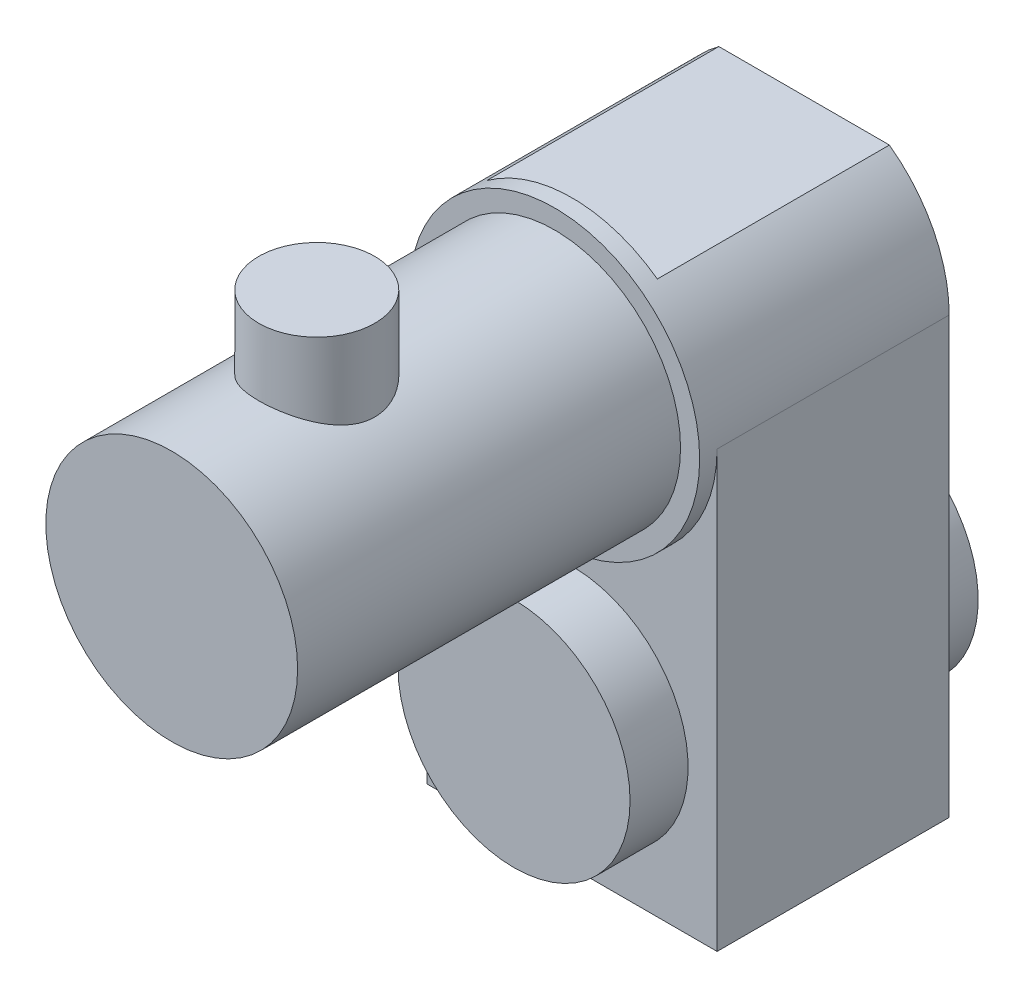
ISO-10303-21;
HEADER;
FILE_DESCRIPTION(('STEP AP214'),'2;1');
FILE_NAME('part.step','',(''),(''),'','','');
FILE_SCHEMA(('AUTOMOTIVE_DESIGN { 1 0 10303 214 1 1 1 1 }'));
ENDSEC;
DATA;
#1=APPLICATION_CONTEXT('core data for automotive mechanical design processes');
#2=APPLICATION_PROTOCOL_DEFINITION('international standard','automotive_design',2000,#1);
#3=PRODUCT_CONTEXT('',#1,'mechanical');
#4=PRODUCT('Part','Part','',(#3));
#5=PRODUCT_RELATED_PRODUCT_CATEGORY('part','',(#4));
#6=PRODUCT_DEFINITION_FORMATION('','',#4);
#7=PRODUCT_DEFINITION_CONTEXT('part definition',#1,'design');
#8=PRODUCT_DEFINITION('design','',#6,#7);
#9=PRODUCT_DEFINITION_SHAPE('','',#8);
#10=(LENGTH_UNIT() NAMED_UNIT(*) SI_UNIT(.MILLI.,.METRE.));
#11=(NAMED_UNIT(*) PLANE_ANGLE_UNIT() SI_UNIT($,.RADIAN.));
#12=(NAMED_UNIT(*) SI_UNIT($,.STERADIAN.) SOLID_ANGLE_UNIT());
#13=UNCERTAINTY_MEASURE_WITH_UNIT(LENGTH_MEASURE(1.E-05),#10,'distance_accuracy_value','');
#14=(GEOMETRIC_REPRESENTATION_CONTEXT(3) GLOBAL_UNCERTAINTY_ASSIGNED_CONTEXT((#13)) GLOBAL_UNIT_ASSIGNED_CONTEXT((#10,
#11,#12)) REPRESENTATION_CONTEXT('',''));
#15=CARTESIAN_POINT('',(0.,0.,0.));
#16=DIRECTION('',(0.,0.,1.));
#17=DIRECTION('',(1.,0.,0.));
#18=AXIS2_PLACEMENT_3D('',#15,#16,#17);
#19=CARTESIAN_POINT('',(0.,0.,0.));
#20=DIRECTION('',(0.,0.,1.));
#21=DIRECTION('',(1.,0.,0.));
#22=AXIS2_PLACEMENT_3D('',#19,#20,#21);
#23=PLANE('',#22);
#24=DIRECTION('',(1.,0.,0.));
#25=VECTOR('',#24,1.);
#26=CARTESIAN_POINT('',(73.4963775843918,101.110249144053,0.));
#27=LINE('',#26,#25);
#28=CARTESIAN_POINT('',(-73.4963775843918,101.110249144053,0.));
#29=VERTEX_POINT('',#28);
#30=CARTESIAN_POINT('',(73.4963775843918,101.110249144053,0.));
#31=VERTEX_POINT('',#30);
#32=EDGE_CURVE('E57',#29,#31,#27,.T.);
#33=ORIENTED_EDGE('',*,*,#32,.F.);
#34=CARTESIAN_POINT('',(0.,0.,0.));
#35=DIRECTION('',(0.,0.,1.));
#36=DIRECTION('',(1.,0.,0.));
#37=AXIS2_PLACEMENT_3D('',#34,#35,#36);
#38=CIRCLE('',#37,125.);
#39=EDGE_CURVE('E127',#31,#29,#38,.T.);
#40=ORIENTED_EDGE('',*,*,#39,.F.);
#41=EDGE_LOOP('',(#33,#40));
#42=FACE_BOUND('',#41,.T.);
#43=ADVANCED_FACE('F35',(#42),#23,.F.);
#44=CARTESIAN_POINT('',(0.,0.,15.));
#45=DIRECTION('',(0.,0.,-1.));
#46=DIRECTION('',(-1.,0.,0.));
#47=AXIS2_PLACEMENT_3D('',#44,#45,#46);
#48=CYLINDRICAL_SURFACE('',#47,125.);
#49=CARTESIAN_POINT('',(0.,0.,15.));
#50=DIRECTION('',(0.,0.,1.));
#51=DIRECTION('',(1.,0.,0.));
#52=AXIS2_PLACEMENT_3D('',#49,#50,#51);
#53=CIRCLE('',#52,125.);
#54=CARTESIAN_POINT('',(125.,0.,15.));
#55=VERTEX_POINT('',#54);
#56=EDGE_CURVE('E124',#55,#55,#53,.T.);
#57=ORIENTED_EDGE('',*,*,#56,.F.);
#58=EDGE_LOOP('',(#57));
#59=FACE_BOUND('',#58,.T.);
#60=CARTESIAN_POINT('',(-125.,0.,0.));
#61=VERTEX_POINT('',#60);
#62=CARTESIAN_POINT('',(125.,0.,0.));
#63=VERTEX_POINT('',#62);
#64=EDGE_CURVE('E50',#61,#63,#38,.T.);
#65=ORIENTED_EDGE('',*,*,#64,.T.);
#66=DIRECTION('',(0.,0.,1.));
#67=VECTOR('',#66,1.);
#68=CARTESIAN_POINT('',(125.,0.,-200.));
#69=LINE('',#68,#67);
#70=CARTESIAN_POINT('',(125.,0.,-200.));
#71=VERTEX_POINT('',#70);
#72=EDGE_CURVE('E93',#71,#63,#69,.T.);
#73=ORIENTED_EDGE('',*,*,#72,.F.);
#74=CARTESIAN_POINT('',(-8.451572774959E-12,-4.3159920082303E-12,-200.));
#75=DIRECTION('',(0.,0.,-1.));
#76=DIRECTION('',(-1.,0.,0.));
#77=AXIS2_PLACEMENT_3D('',#74,#75,#76);
#78=CIRCLE('',#77,125.000000000008);
#79=CARTESIAN_POINT('',(73.4963775843918,101.110249144053,-200.));
#80=VERTEX_POINT('',#79);
#81=EDGE_CURVE('E99',#80,#71,#78,.T.);
#82=ORIENTED_EDGE('',*,*,#81,.F.);
#83=DIRECTION('',(0.,0.,1.));
#84=VECTOR('',#83,1.);
#85=CARTESIAN_POINT('',(73.4963775843918,101.110249144053,-200.));
#86=LINE('',#85,#84);
#87=EDGE_CURVE('E314',#80,#31,#86,.T.);
#88=ORIENTED_EDGE('',*,*,#87,.T.);
#89=ORIENTED_EDGE('',*,*,#39,.T.);
#90=DIRECTION('',(0.,0.,1.));
#91=VECTOR('',#90,1.);
#92=CARTESIAN_POINT('',(-73.4963775843918,101.110249144053,-200.));
#93=LINE('',#92,#91);
#94=CARTESIAN_POINT('',(-73.4963775843918,101.110249144053,-200.));
#95=VERTEX_POINT('',#94);
#96=EDGE_CURVE('E322',#95,#29,#93,.T.);
#97=ORIENTED_EDGE('',*,*,#96,.F.);
#98=CARTESIAN_POINT('',(6.24500451351651E-13,-3.2612801348364E-13,-200.));
#99=DIRECTION('',(0.,0.,-1.));
#100=DIRECTION('',(-1.,0.,0.));
#101=AXIS2_PLACEMENT_3D('',#98,#99,#100);
#102=CIRCLE('',#101,125.000000000001);
#103=CARTESIAN_POINT('',(-125.,0.,-200.));
#104=VERTEX_POINT('',#103);
#105=EDGE_CURVE('E311',#104,#95,#102,.T.);
#106=ORIENTED_EDGE('',*,*,#105,.F.);
#107=DIRECTION('',(0.,0.,1.));
#108=VECTOR('',#107,1.);
#109=CARTESIAN_POINT('',(-125.,0.,-200.));
#110=LINE('',#109,#108);
#111=EDGE_CURVE('E325',#104,#61,#110,.T.);
#112=ORIENTED_EDGE('',*,*,#111,.T.);
#113=EDGE_LOOP('',(#65,#73,#82,#88,#89,#97,#106,#112));
#114=FACE_BOUND('',#113,.T.);
#115=ADVANCED_FACE('F37',(#59,#114),#48,.T.);
#116=CARTESIAN_POINT('',(0.,0.,15.));
#117=DIRECTION('',(0.,0.,1.));
#118=DIRECTION('',(1.,0.,0.));
#119=AXIS2_PLACEMENT_3D('',#116,#117,#118);
#120=PLANE('',#119);
#121=CARTESIAN_POINT('',(0.,0.,15.));
#122=DIRECTION('',(0.,0.,1.));
#123=DIRECTION('',(1.,0.,0.));
#124=AXIS2_PLACEMENT_3D('',#121,#122,#123);
#125=CIRCLE('',#124,108.5);
#126=CARTESIAN_POINT('',(108.5,0.,15.));
#127=VERTEX_POINT('',#126);
#128=EDGE_CURVE('E113',#127,#127,#125,.T.);
#129=ORIENTED_EDGE('',*,*,#128,.F.);
#130=EDGE_LOOP('',(#129));
#131=FACE_BOUND('',#130,.T.);
#132=ORIENTED_EDGE('',*,*,#56,.T.);
#133=EDGE_LOOP('',(#132));
#134=FACE_BOUND('',#133,.T.);
#135=ADVANCED_FACE('F150',(#131,#134),#120,.T.);
#136=CARTESIAN_POINT('',(0.,0.,345.));
#137=DIRECTION('',(0.,0.,-1.));
#138=DIRECTION('',(-1.,0.,0.));
#139=AXIS2_PLACEMENT_3D('',#136,#137,#138);
#140=CYLINDRICAL_SURFACE('',#139,108.5);
#141=CARTESIAN_POINT('',(0.,108.5,270.));
#142=CARTESIAN_POINT('',(-1.32696206149475,108.49999184715,269.999990503253));
#143=CARTESIAN_POINT('',(-2.65417466500484,108.475594848356,269.94710906297));
#144=CARTESIAN_POINT('',(-5.29899301202294,108.378612224787,269.736124858545));
#145=CARTESIAN_POINT('',(-6.61659325685497,108.306000917281,269.577966015267));
#146=CARTESIAN_POINT('',(-9.23443841105052,108.114295731333,269.157766126817));
#147=CARTESIAN_POINT('',(-10.5346428110665,107.995108101183,268.895515542515));
#148=CARTESIAN_POINT('',(-13.1054870587458,107.713362431829,268.270035244358));
#149=CARTESIAN_POINT('',(-14.3761306315122,107.550809889787,267.906818329275));
#150=CARTESIAN_POINT('',(-16.8750052499934,107.187092042421,267.084584064535));
#151=CARTESIAN_POINT('',(-18.1033750329911,106.98607087299,266.625923782468));
#152=CARTESIAN_POINT('',(-20.5152107103846,106.549885900575,265.616175256917));
#153=CARTESIAN_POINT('',(-21.6986753288033,106.314721128317,265.065084389433));
#154=CARTESIAN_POINT('',(-24.0138420241665,105.815818299413,263.875152608911));
#155=CARTESIAN_POINT('',(-25.1455587150909,105.552088381531,263.236336676626));
#156=CARTESIAN_POINT('',(-27.3519501979903,105.001970135357,261.87542254575));
#157=CARTESIAN_POINT('',(-28.4266232475368,104.715581115596,261.153321805316));
#158=CARTESIAN_POINT('',(-30.5699430770528,104.11068294951,259.58954161615));
#159=CARTESIAN_POINT('',(-31.6351689943676,103.791274829477,258.743523718862));
#160=CARTESIAN_POINT('',(-33.6915707166659,103.142089031261,256.969203604267));
#161=CARTESIAN_POINT('',(-34.6827441461133,102.812311020904,256.040898749356));
#162=CARTESIAN_POINT('',(-36.1102863670655,102.315940203102,254.590578087172));
#163=CARTESIAN_POINT('',(-36.5764457713409,102.150129939262,254.097276620902));
#164=CARTESIAN_POINT('',(-37.488369464531,101.818993077173,253.092031636386));
#165=CARTESIAN_POINT('',(-37.9341352984982,101.653666443174,252.58008953568));
#166=CARTESIAN_POINT('',(-38.8046541409788,101.324554544605,251.538224504586));
#167=CARTESIAN_POINT('',(-39.229408630431,101.160769172063,251.008302845898));
#168=CARTESIAN_POINT('',(-40.0574424830926,100.83575367066,249.93097217927));
#169=CARTESIAN_POINT('',(-40.4607155527856,100.674524300255,249.383558120833));
#170=CARTESIAN_POINT('',(-41.6868212936223,100.176189573054,247.645983008476));
#171=CARTESIAN_POINT('',(-42.4707628094322,99.8454724597847,246.426160122134));
#172=CARTESIAN_POINT('',(-43.9323375662214,99.2110628403277,243.917699935727));
#173=CARTESIAN_POINT('',(-44.6099768192685,98.9073688062338,242.629066532863));
#174=CARTESIAN_POINT('',(-45.5419879985755,98.4799165544863,240.650882298602));
#175=CARTESIAN_POINT('',(-45.838578124882,98.342116686029,239.983963848155));
#176=CARTESIAN_POINT('',(-46.4028967814605,98.0771041328612,238.636112630325));
#177=CARTESIAN_POINT('',(-46.6706326630929,97.9498887533721,237.955183485427));
#178=CARTESIAN_POINT('',(-47.1765683428826,97.7072165699477,236.580346962876));
#179=CARTESIAN_POINT('',(-47.4147673867384,97.5917600663199,235.8864392543));
#180=CARTESIAN_POINT('',(-47.8609129057342,97.373736226732,234.486982430335));
#181=CARTESIAN_POINT('',(-48.0688577949849,97.2711695664817,233.78143270684));
#182=CARTESIAN_POINT('',(-48.6250798484449,96.9949370373942,231.727590268775));
#183=CARTESIAN_POINT('',(-48.933654442626,96.8391802158025,230.365815838871));
#184=CARTESIAN_POINT('',(-49.4362784180271,96.5835596810472,227.616294964833));
#185=CARTESIAN_POINT('',(-49.6303320223907,96.4836939068194,226.22854948037));
#186=CARTESIAN_POINT('',(-49.9012165508031,96.343873723886,223.439482371492));
#187=CARTESIAN_POINT('',(-49.9781226504755,96.3038808939374,222.03817003476));
#188=CARTESIAN_POINT('',(-50.0137887636891,96.2853650460038,219.233699366847));
#189=CARTESIAN_POINT('',(-49.9725573079794,96.3068375895851,217.830541176269));
#190=CARTESIAN_POINT('',(-49.7824072723167,96.405246400336,215.17190642304));
#191=CARTESIAN_POINT('',(-49.6444258536115,96.4765472700731,213.91541962773));
#192=CARTESIAN_POINT('',(-49.2744881228048,96.6660126637762,211.420049771231));
#193=CARTESIAN_POINT('',(-49.0425389499149,96.7841736275264,210.181165380096));
#194=CARTESIAN_POINT('',(-48.4871139558731,97.0636192512721,207.728863950343));
#195=CARTESIAN_POINT('',(-48.1636210204798,97.2249119745029,206.515451719389));
#196=CARTESIAN_POINT('',(-47.4283037090085,97.5857240969431,204.121579654354));
#197=CARTESIAN_POINT('',(-47.0164752315451,97.7852452710386,202.941121353188));
#198=CARTESIAN_POINT('',(-46.097589003223,98.2218238977522,200.592841856404));
#199=CARTESIAN_POINT('',(-45.5885699873429,98.4596349918026,199.425926024842));
#200=CARTESIAN_POINT('',(-44.7616690175812,98.8369092782603,197.711078403503));
#201=CARTESIAN_POINT('',(-44.4754583042851,98.9661002211117,197.145357726293));
#202=CARTESIAN_POINT('',(-43.8823118907455,99.230530542835,196.026184620708));
#203=CARTESIAN_POINT('',(-43.5753723507745,99.3657710407278,195.472734490642));
#204=CARTESIAN_POINT('',(-42.6241547562215,99.7793044063888,193.831692261469));
#205=CARTESIAN_POINT('',(-41.9495102314699,100.065394168314,192.763475644041));
#206=CARTESIAN_POINT('',(-40.5233345565621,100.651396042653,190.683629888935));
#207=CARTESIAN_POINT('',(-39.7717981342937,100.95130910209,189.672004638825));
#208=CARTESIAN_POINT('',(-38.5481537375097,101.422423067206,188.148405294664));
#209=CARTESIAN_POINT('',(-38.1013083329258,101.591231788832,187.615222413365));
#210=CARTESIAN_POINT('',(-37.1860427356225,101.929810781875,186.568254060384));
#211=CARTESIAN_POINT('',(-36.7176271700967,102.099580840279,186.054464471122));
#212=CARTESIAN_POINT('',(-35.2806853614013,102.608749649752,184.542900029686));
#213=CARTESIAN_POINT('',(-34.2804333343782,102.948018968357,183.574891325848));
#214=CARTESIAN_POINT('',(-32.2007225652056,103.617360295732,181.723998168457));
#215=CARTESIAN_POINT('',(-31.121236519604,103.947429079494,180.841143303094));
#216=CARTESIAN_POINT('',(-28.8888124321367,104.589843427866,179.166394396951));
#217=CARTESIAN_POINT('',(-27.7358743179883,104.902188975035,178.374500445686));
#218=CARTESIAN_POINT('',(-25.3223144166532,105.511285692345,176.862117880167));
#219=CARTESIAN_POINT('',(-24.0593622815635,105.807143185556,176.144980625508));
#220=CARTESIAN_POINT('',(-21.4693946995538,106.362911929998,174.820574985013));
#221=CARTESIAN_POINT('',(-20.1423769780471,106.622821903678,174.213310503742));
#222=CARTESIAN_POINT('',(-17.4342225687673,107.098957911469,173.115231283393));
#223=CARTESIAN_POINT('',(-16.0531158658935,107.315207751031,172.62435305974));
#224=CARTESIAN_POINT('',(-13.2467649027633,107.697622068747,171.764366292778));
#225=CARTESIAN_POINT('',(-11.8215248747163,107.863791333126,171.395246112675));
#226=CARTESIAN_POINT('',(-9.04541354303032,108.130611919275,170.806069447762));
#227=CARTESIAN_POINT('',(-7.69682446163209,108.235195888614,170.577016790092));
#228=CARTESIAN_POINT('',(-4.98248871170465,108.394061178617,170.230065027786));
#229=CARTESIAN_POINT('',(-3.61674288533486,108.448344958624,170.112160488747));
#230=CARTESIAN_POINT('',(-0.87954775825578,108.505067945424,169.98897379894));
#231=CARTESIAN_POINT('',(0.491899579846575,108.507523718354,169.983655661417));
#232=CARTESIAN_POINT('',(3.22968266518204,108.460561090468,170.085619205596));
#233=CARTESIAN_POINT('',(4.59601857631193,108.411144367492,170.192897245326));
#234=CARTESIAN_POINT('',(7.22606712823257,108.266601798517,170.508332337941));
#235=CARTESIAN_POINT('',(8.49078040689456,108.174582523499,170.709640470707));
#236=CARTESIAN_POINT('',(10.997371245127,107.948558174574,171.207680399908));
#237=CARTESIAN_POINT('',(12.2392500065103,107.814555317056,171.504407159041));
#238=CARTESIAN_POINT('',(14.6923022800147,107.507741466231,172.190393128745));
#239=CARTESIAN_POINT('',(15.9034738284649,107.334927997985,172.579658240544));
#240=CARTESIAN_POINT('',(18.2878624220879,106.954485005605,173.44719386382));
#241=CARTESIAN_POINT('',(19.4610779548012,106.746854096109,173.925467916982));
#242=CARTESIAN_POINT('',(21.7985913638681,106.294552666553,174.983142777684));
#243=CARTESIAN_POINT('',(22.9615015267723,106.048938266458,175.565204659199));
#244=CARTESIAN_POINT('',(25.2340117754535,105.531288828472,176.815205650263));
#245=CARTESIAN_POINT('',(26.343611240036,105.259253482827,177.483145760161));
#246=CARTESIAN_POINT('',(28.5044754089206,104.69475908064,178.900543681469));
#247=CARTESIAN_POINT('',(29.5557193477624,104.402292836441,179.65003023341));
#248=CARTESIAN_POINT('',(31.5948380141804,103.803397129777,181.225957391722));
#249=CARTESIAN_POINT('',(32.5827095941811,103.496966975044,182.052401815442));
#250=CARTESIAN_POINT('',(34.0544852155687,103.018634478328,183.383336838088));
#251=CARTESIAN_POINT('',(34.5624348673959,102.849232885091,183.862410869021));
#252=CARTESIAN_POINT('',(35.5576610429205,102.509409858624,184.841220713372));
#253=CARTESIAN_POINT('',(36.0449386772386,102.338988480745,185.340955413923));
#254=CARTESIAN_POINT('',(36.9981452289964,101.998252112999,186.360377736218));
#255=CARTESIAN_POINT('',(37.4640751161241,101.827937118649,186.880064449698));
#256=CARTESIAN_POINT('',(38.374059131696,101.488509323494,187.938823302328));
#257=CARTESIAN_POINT('',(38.8181075850204,101.319396844202,188.477900408464));
#258=CARTESIAN_POINT('',(40.1165621852611,100.815541302886,190.123354239537));
#259=CARTESIAN_POINT('',(40.9371503969822,100.484326083122,191.257817481722));
#260=CARTESIAN_POINT('',(42.4824450134894,99.8408373428742,193.595368452759));
#261=CARTESIAN_POINT('',(43.2071554477477,99.5285630266566,194.798453294595));
#262=CARTESIAN_POINT('',(44.2283610426945,99.0769710415183,196.668109819704));
#263=CARTESIAN_POINT('',(44.5621371493618,98.9271926468688,197.31204749307));
#264=CARTESIAN_POINT('',(45.2020218777676,98.6364572337708,198.615333407954));
#265=CARTESIAN_POINT('',(45.508137050641,98.4954981290329,199.274677953747));
#266=CARTESIAN_POINT('',(46.0920495749664,98.2236056971569,200.607921704567));
#267=CARTESIAN_POINT('',(46.3698430617873,98.0926737388764,201.281822880752));
#268=CARTESIAN_POINT('',(46.8963461511226,97.8420550605545,202.643006299132));
#269=CARTESIAN_POINT('',(47.145054008241,97.7223690154523,203.330289341474));
#270=CARTESIAN_POINT('',(47.6124318633626,97.4955063733586,204.716324738788));
#271=CARTESIAN_POINT('',(47.8311288228944,97.3883185612513,205.415066159308));
#272=CARTESIAN_POINT('',(48.2380657186767,97.1873989888575,206.823272144494));
#273=CARTESIAN_POINT('',(48.4263059583223,97.0936670945309,207.532736602265));
#274=CARTESIAN_POINT('',(48.7716851557486,96.9206378521882,208.960870152485));
#275=CARTESIAN_POINT('',(48.9288270427158,96.8413391447517,209.679538371227));
#276=CARTESIAN_POINT('',(49.2114705939299,96.6980159740271,211.124577179446));
#277=CARTESIAN_POINT('',(49.3369728846618,96.6339912083063,211.850947616118));
#278=CARTESIAN_POINT('',(49.5461368757242,96.5269021661968,213.244861724335));
#279=CARTESIAN_POINT('',(49.632526665777,96.4824803405472,213.911893240495));
#280=CARTESIAN_POINT('',(49.7783861850178,96.4073078966164,215.249730212616));
#281=CARTESIAN_POINT('',(49.8378534315836,96.376558539126,215.920536010844));
#282=CARTESIAN_POINT('',(49.9296501833039,96.3290335507053,217.264390808045));
#283=CARTESIAN_POINT('',(49.9619839204068,96.3122557406695,217.937439440761));
#284=CARTESIAN_POINT('',(49.9994224438082,96.2928252870462,219.284568893838));
#285=CARTESIAN_POINT('',(50.0045243751537,96.2901741244812,219.958649815013));
#286=CARTESIAN_POINT('',(49.9874767378458,96.2990252440633,221.306147983991));
#287=CARTESIAN_POINT('',(49.9653363126947,96.3105227774058,221.979565378592));
#288=CARTESIAN_POINT('',(49.8938915386398,96.3475541696476,223.324641720082));
#289=CARTESIAN_POINT('',(49.8445841588559,96.3730895946832,223.996300462365));
#290=CARTESIAN_POINT('',(49.7189725881016,96.4379530569606,225.336339459925));
#291=CARTESIAN_POINT('',(49.6426719316027,96.4772792884426,226.004720132817));
#292=CARTESIAN_POINT('',(49.4633280364868,96.5693491988312,227.336972801881));
#293=CARTESIAN_POINT('',(49.360282253194,96.6220941544581,228.000844362861));
#294=CARTESIAN_POINT('',(49.0276789697546,96.7915106628985,229.891660503494));
#295=CARTESIAN_POINT('',(48.7655524524284,96.9241392022563,231.11163862225));
#296=CARTESIAN_POINT('',(48.1524952363855,97.2301603439627,233.523540129014));
#297=CARTESIAN_POINT('',(47.8015697525409,97.4035505524696,234.715465159997));
#298=CARTESIAN_POINT('',(47.014041248206,97.786100583307,237.065030597021));
#299=CARTESIAN_POINT('',(46.5774200365272,97.9952679990836,238.222663663529));
#300=CARTESIAN_POINT('',(45.6220832812351,98.4436578479836,240.49750663564));
#301=CARTESIAN_POINT('',(45.1033628570524,98.6828820677258,241.6147141332));
#302=CARTESIAN_POINT('',(43.9507719301887,99.2018386123404,243.875588057136));
#303=CARTESIAN_POINT('',(43.3115728642342,99.4832001458293,245.016164640363));
#304=CARTESIAN_POINT('',(41.9484590275373,100.065608324201,247.240193459189));
#305=CARTESIAN_POINT('',(41.2245416035932,100.366655585469,248.323643904173));
#306=CARTESIAN_POINT('',(39.6959739122507,100.98097953505,250.42897449615));
#307=CARTESIAN_POINT('',(38.8912932456651,101.294260800917,251.450831225959));
#308=CARTESIAN_POINT('',(37.2055985684003,101.925480012426,253.42800242767));
#309=CARTESIAN_POINT('',(36.3245809820111,102.243418175622,254.383313778723));
#310=CARTESIAN_POINT('',(34.4013720959535,102.907375986398,256.31219801978));
#311=CARTESIAN_POINT('',(33.3518362359986,103.25312876439,257.278557268426));
#312=CARTESIAN_POINT('',(31.1715736068251,103.932125494348,259.119934747322));
#313=CARTESIAN_POINT('',(30.0408407774525,104.265368509812,259.994946147821));
#314=CARTESIAN_POINT('',(27.7037601945411,104.910540854896,261.647941226426));
#315=CARTESIAN_POINT('',(26.4973722671363,105.222458673634,262.425872686943));
#316=CARTESIAN_POINT('',(24.0166833576599,105.816234897773,263.87783629658));
#317=CARTESIAN_POINT('',(22.7423872925281,106.098095475069,264.551875954347));
#318=CARTESIAN_POINT('',(20.1427635983182,106.62205858017,265.785624300879));
#319=CARTESIAN_POINT('',(18.8178578062201,106.864426733446,266.346103589292));
#320=CARTESIAN_POINT('',(16.7933311901756,107.194696168522,267.100994385568));
#321=CARTESIAN_POINT('',(16.1121282176299,107.299259714057,267.338366110313));
#322=CARTESIAN_POINT('',(14.7385558550677,107.496539342476,267.783846291984));
#323=CARTESIAN_POINT('',(14.0461877733764,107.589256802283,267.991958150196));
#324=CARTESIAN_POINT('',(12.653403741467,107.761925724363,268.377807938282));
#325=CARTESIAN_POINT('',(11.9530127721025,107.841909091016,268.555621858695));
#326=CARTESIAN_POINT('',(10.5439517482036,107.988780541837,268.880955397435));
#327=CARTESIAN_POINT('',(9.83528271594334,108.055670225225,269.028478715468));
#328=CARTESIAN_POINT('',(8.41146319929416,108.175817453214,269.292710575638));
#329=CARTESIAN_POINT('',(7.69631625171861,108.229082021139,269.409434994635));
#330=CARTESIAN_POINT('',(6.26082845466192,108.321600526142,269.611765319664));
#331=CARTESIAN_POINT('',(5.5404885228333,108.36085687956,269.69737659259));
#332=CARTESIAN_POINT('',(4.41828699683054,108.410743085296,269.80602731344));
#333=CARTESIAN_POINT('',(4.01766382369642,108.426331785784,269.839944657368));
#334=CARTESIAN_POINT('',(3.21565882236431,108.453079508879,269.89810747679));
#335=CARTESIAN_POINT('',(2.81427719136392,108.464239556581,269.922355190513));
#336=CARTESIAN_POINT('',(1.60921489000734,108.491041960758,269.98057018258));
#337=CARTESIAN_POINT('',(0.804653507914226,108.500004943788,270.000005758711));
#338=CARTESIAN_POINT('',(0.,108.5,270.));
#339=B_SPLINE_CURVE_WITH_KNOTS('',3,(#141,#142,#143,#144,#145,#146,#147,#148,#149,#150,#151,
#152,#153,#154,#155,#156,#157,#158,#159,#160,#161,#162,#163,#164,#165,#166,#167,#168,#169,#170,
#171,#172,#173,#174,#175,#176,#177,#178,#179,#180,#181,#182,#183,#184,#185,#186,#187,#188,#189,
#190,#191,#192,#193,#194,#195,#196,#197,#198,#199,#200,#201,#202,#203,#204,#205,#206,#207,#208,
#209,#210,#211,#212,#213,#214,#215,#216,#217,#218,#219,#220,#221,#222,#223,#224,#225,#226,#227,
#228,#229,#230,#231,#232,#233,#234,#235,#236,#237,#238,#239,#240,#241,#242,#243,#244,#245,#246,
#247,#248,#249,#250,#251,#252,#253,#254,#255,#256,#257,#258,#259,#260,#261,#262,#263,#264,#265,
#266,#267,#268,#269,#270,#271,#272,#273,#274,#275,#276,#277,#278,#279,#280,#281,#282,#283,#284,
#285,#286,#287,#288,#289,#290,#291,#292,#293,#294,#295,#296,#297,#298,#299,#300,#301,#302,#303,
#304,#305,#306,#307,#308,#309,#310,#311,#312,#313,#314,#315,#316,#317,#318,#319,#320,#321,#322,
#323,#324,#325,#326,#327,#328,#329,#330,#331,#332,#333,#334,#335,#336,#337,#338),.UNSPECIFIED.,
.T.,.F.,(4,2,2,2,2,2,2,2,2,2,2,2,2,2,2,2,2,2,2,2,2,2,2,2,2,2,2,2,2,2,2,2,2,2,2,2,2,2,2,2,2,2,2,
2,2,2,2,2,2,2,2,2,2,2,2,2,2,2,2,2,2,2,2,2,2,2,2,2,2,2,2,2,2,2,2,2,2,2,2,2,2,2,2,2,2,2,2,2,2,2,2,
2,2,2,2,2,2,2,4),(0.,3.98005084870969,7.96222348813822,11.9524533242832,15.9421775783226,
19.9172357254729,23.892406739164,27.8664481140044,31.8406108082757,36.0281280471211,
40.2157795600646,42.3113501993137,44.4067618106464,46.5020255204028,48.5978997511366,
53.0537927918351,57.5094337325714,59.7371552405175,61.9643078306767,64.1915172853663,
66.418843445883,70.6273762338787,74.8357538158381,79.0414296681492,83.246801834973,
87.0404894056553,90.833888804503,94.6279978540046,98.4222831006744,102.303282714446,
104.243965454083,106.18500866955,110.067323220193,113.94990414132,116.09693829733,
118.243514001558,122.536514640427,126.831001623942,131.125492833644,135.566276018852,
140.007216985885,144.44572997539,148.883818639413,152.994110567821,157.104201519914,
161.21297871596,165.321623015916,169.16899056201,173.016155032724,176.863564905295,
180.711127899913,184.677200121232,188.643318545382,192.610839359001,196.57855707895,
198.73350967376,200.888346345017,203.043085038971,205.198379671096,209.50954253868,
213.820524162674,216.041724562291,218.262397512862,220.483373080555,222.704481858186,
224.923581961375,227.14265995761,229.36152883697,231.580353777808,233.601887429077,
235.623607455098,237.645012099653,239.666628661919,241.68756688292,243.708730615475,
245.729629796846,247.750721328001,251.510684058583,255.270426030112,259.03096697136,
262.79173155032,266.799758903238,270.807911812798,274.817579084794,278.827434275903,
283.226161073319,287.625216512601,292.026628019938,296.427721271614,300.797867929584,
302.983979339302,305.169836416043,307.350127739702,309.530152603071,311.709051456361,
313.887574279656,315.094525526453,316.301197237919,318.714651224301),.UNSPECIFIED.);
#340=CARTESIAN_POINT('',(0.,108.5,270.));
#341=VERTEX_POINT('',#340);
#342=EDGE_CURVE('E43',#341,#341,#339,.T.);
#343=ORIENTED_EDGE('',*,*,#342,.T.);
#344=EDGE_LOOP('',(#343));
#345=FACE_BOUND('',#344,.T.);
#346=CARTESIAN_POINT('',(0.,0.,345.));
#347=DIRECTION('',(0.,0.,1.));
#348=DIRECTION('',(1.,0.,0.));
#349=AXIS2_PLACEMENT_3D('',#346,#347,#348);
#350=CIRCLE('',#349,108.5);
#351=CARTESIAN_POINT('',(108.5,0.,345.));
#352=VERTEX_POINT('',#351);
#353=EDGE_CURVE('E119',#352,#352,#350,.T.);
#354=ORIENTED_EDGE('',*,*,#353,.F.);
#355=EDGE_LOOP('',(#354));
#356=FACE_BOUND('',#355,.T.);
#357=ORIENTED_EDGE('',*,*,#128,.T.);
#358=EDGE_LOOP('',(#357));
#359=FACE_BOUND('',#358,.T.);
#360=ADVANCED_FACE('F133',(#345,#356,#359),#140,.T.);
#361=CARTESIAN_POINT('',(0.,0.,345.));
#362=DIRECTION('',(0.,0.,1.));
#363=DIRECTION('',(1.,0.,0.));
#364=AXIS2_PLACEMENT_3D('',#361,#362,#363);
#365=PLANE('',#364);
#366=ORIENTED_EDGE('',*,*,#353,.T.);
#367=EDGE_LOOP('',(#366));
#368=FACE_BOUND('',#367,.T.);
#369=ADVANCED_FACE('F142',(#368),#365,.T.);
#370=CARTESIAN_POINT('',(0.,165.766992941321,220.));
#371=DIRECTION('',(0.,1.,0.));
#372=DIRECTION('',(0.,0.,1.));
#373=AXIS2_PLACEMENT_3D('',#370,#371,#372);
#374=CYLINDRICAL_SURFACE('',#373,50.);
#375=CARTESIAN_POINT('',(0.,166.292523074224,220.));
#376=DIRECTION('',(0.,1.,0.));
#377=DIRECTION('',(0.,0.,1.));
#378=AXIS2_PLACEMENT_3D('',#375,#376,#377);
#379=CIRCLE('',#378,50.);
#380=CARTESIAN_POINT('',(0.,166.292523074224,270.));
#381=VERTEX_POINT('',#380);
#382=EDGE_CURVE('E110',#381,#381,#379,.T.);
#383=ORIENTED_EDGE('',*,*,#382,.F.);
#384=EDGE_LOOP('',(#383));
#385=FACE_BOUND('',#384,.T.);
#386=ORIENTED_EDGE('',*,*,#342,.F.);
#387=EDGE_LOOP('',(#386));
#388=FACE_BOUND('',#387,.T.);
#389=ADVANCED_FACE('F137',(#385,#388),#374,.T.);
#390=CARTESIAN_POINT('',(-50.,166.292523074224,220.));
#391=DIRECTION('',(0.,1.,0.));
#392=DIRECTION('',(0.,0.,1.));
#393=AXIS2_PLACEMENT_3D('',#390,#391,#392);
#394=PLANE('',#393);
#395=ORIENTED_EDGE('',*,*,#382,.T.);
#396=EDGE_LOOP('',(#395));
#397=FACE_BOUND('',#396,.T.);
#398=ADVANCED_FACE('F141',(#397),#394,.T.);
#399=CARTESIAN_POINT('',(125.,0.,-200.));
#400=DIRECTION('',(-1.,0.,0.));
#401=DIRECTION('',(0.,0.,1.));
#402=AXIS2_PLACEMENT_3D('',#399,#400,#401);
#403=PLANE('',#402);
#404=DIRECTION('',(0.,-1.,0.));
#405=VECTOR('',#404,1.);
#406=CARTESIAN_POINT('',(125.,0.,0.));
#407=LINE('',#406,#405);
#408=CARTESIAN_POINT('',(125.,-375.,0.));
#409=VERTEX_POINT('',#408);
#410=EDGE_CURVE('E306',#63,#409,#407,.T.);
#411=ORIENTED_EDGE('',*,*,#410,.T.);
#412=DIRECTION('',(0.,0.,1.));
#413=VECTOR('',#412,1.);
#414=CARTESIAN_POINT('',(125.,-375.,-200.));
#415=LINE('',#414,#413);
#416=CARTESIAN_POINT('',(125.,-375.,-200.));
#417=VERTEX_POINT('',#416);
#418=EDGE_CURVE('E95',#417,#409,#415,.T.);
#419=ORIENTED_EDGE('',*,*,#418,.F.);
#420=DIRECTION('',(0.,-1.,0.));
#421=VECTOR('',#420,1.);
#422=CARTESIAN_POINT('',(125.,0.,-200.));
#423=LINE('',#422,#421);
#424=EDGE_CURVE('E89',#71,#417,#423,.T.);
#425=ORIENTED_EDGE('',*,*,#424,.F.);
#426=ORIENTED_EDGE('',*,*,#72,.T.);
#427=EDGE_LOOP('',(#411,#419,#425,#426));
#428=FACE_BOUND('',#427,.T.);
#429=ADVANCED_FACE('F91',(#428),#403,.F.);
#430=CARTESIAN_POINT('',(125.,-375.,-200.));
#431=DIRECTION('',(0.,1.,0.));
#432=DIRECTION('',(0.,0.,1.));
#433=AXIS2_PLACEMENT_3D('',#430,#431,#432);
#434=PLANE('',#433);
#435=DIRECTION('',(-1.,0.,0.));
#436=VECTOR('',#435,1.);
#437=CARTESIAN_POINT('',(125.,-375.,0.));
#438=LINE('',#437,#436);
#439=CARTESIAN_POINT('',(-125.,-375.,0.));
#440=VERTEX_POINT('',#439);
#441=EDGE_CURVE('E316',#409,#440,#438,.T.);
#442=ORIENTED_EDGE('',*,*,#441,.T.);
#443=DIRECTION('',(0.,0.,1.));
#444=VECTOR('',#443,1.);
#445=CARTESIAN_POINT('',(-125.,-375.,-200.));
#446=LINE('',#445,#444);
#447=CARTESIAN_POINT('',(-125.,-375.,-200.));
#448=VERTEX_POINT('',#447);
#449=EDGE_CURVE('E115',#448,#440,#446,.T.);
#450=ORIENTED_EDGE('',*,*,#449,.F.);
#451=DIRECTION('',(-1.,0.,0.));
#452=VECTOR('',#451,1.);
#453=CARTESIAN_POINT('',(125.,-375.,-200.));
#454=LINE('',#453,#452);
#455=EDGE_CURVE('E98',#417,#448,#454,.T.);
#456=ORIENTED_EDGE('',*,*,#455,.F.);
#457=ORIENTED_EDGE('',*,*,#418,.T.);
#458=EDGE_LOOP('',(#442,#450,#456,#457));
#459=FACE_BOUND('',#458,.T.);
#460=ADVANCED_FACE('F205',(#459),#434,.F.);
#461=CARTESIAN_POINT('',(-125.,-375.,-200.));
#462=DIRECTION('',(1.,0.,0.));
#463=DIRECTION('',(0.,0.,-1.));
#464=AXIS2_PLACEMENT_3D('',#461,#462,#463);
#465=PLANE('',#464);
#466=DIRECTION('',(0.,1.,0.));
#467=VECTOR('',#466,1.);
#468=CARTESIAN_POINT('',(-125.,-375.,0.));
#469=LINE('',#468,#467);
#470=EDGE_CURVE('E318',#440,#61,#469,.T.);
#471=ORIENTED_EDGE('',*,*,#470,.T.);
#472=ORIENTED_EDGE('',*,*,#111,.F.);
#473=DIRECTION('',(0.,1.,0.));
#474=VECTOR('',#473,1.);
#475=CARTESIAN_POINT('',(-125.,-375.,-200.));
#476=LINE('',#475,#474);
#477=EDGE_CURVE('E309',#448,#104,#476,.T.);
#478=ORIENTED_EDGE('',*,*,#477,.F.);
#479=ORIENTED_EDGE('',*,*,#449,.T.);
#480=EDGE_LOOP('',(#471,#472,#478,#479));
#481=FACE_BOUND('',#480,.T.);
#482=ADVANCED_FACE('F213',(#481),#465,.F.);
#483=CARTESIAN_POINT('',(73.4963775843918,101.110249144053,-200.));
#484=DIRECTION('',(0.,-1.,0.));
#485=DIRECTION('',(0.,0.,-1.));
#486=AXIS2_PLACEMENT_3D('',#483,#484,#485);
#487=PLANE('',#486);
#488=ORIENTED_EDGE('',*,*,#32,.T.);
#489=ORIENTED_EDGE('',*,*,#87,.F.);
#490=DIRECTION('',(1.,0.,0.));
#491=VECTOR('',#490,1.);
#492=CARTESIAN_POINT('',(73.4963775843918,101.110249144053,-200.));
#493=LINE('',#492,#491);
#494=EDGE_CURVE('E104',#95,#80,#493,.T.);
#495=ORIENTED_EDGE('',*,*,#494,.F.);
#496=ORIENTED_EDGE('',*,*,#96,.T.);
#497=EDGE_LOOP('',(#488,#489,#495,#496));
#498=FACE_BOUND('',#497,.T.);
#499=ADVANCED_FACE('F223',(#498),#487,.F.);
#500=CARTESIAN_POINT('',(-8.451572774959E-12,-4.3159920082303E-12,-200.));
#501=DIRECTION('',(0.,0.,-1.));
#502=DIRECTION('',(-1.,0.,0.));
#503=AXIS2_PLACEMENT_3D('',#500,#501,#502);
#504=PLANE('',#503);
#505=CARTESIAN_POINT('',(0.,-250.,-200.));
#506=DIRECTION('',(0.,0.,-1.));
#507=DIRECTION('',(-1.,0.,0.));
#508=AXIS2_PLACEMENT_3D('',#505,#506,#507);
#509=CIRCLE('',#508,100.);
#510=CARTESIAN_POINT('',(-100.,-250.,-200.));
#511=VERTEX_POINT('',#510);
#512=EDGE_CURVE('E299',#511,#511,#509,.T.);
#513=ORIENTED_EDGE('',*,*,#512,.F.);
#514=EDGE_LOOP('',(#513));
#515=FACE_BOUND('',#514,.T.);
#516=ORIENTED_EDGE('',*,*,#81,.T.);
#517=ORIENTED_EDGE('',*,*,#424,.T.);
#518=ORIENTED_EDGE('',*,*,#455,.T.);
#519=ORIENTED_EDGE('',*,*,#477,.T.);
#520=ORIENTED_EDGE('',*,*,#105,.T.);
#521=ORIENTED_EDGE('',*,*,#494,.T.);
#522=EDGE_LOOP('',(#516,#517,#518,#519,#520,#521));
#523=FACE_BOUND('',#522,.T.);
#524=ADVANCED_FACE('F102',(#515,#523),#504,.T.);
#525=CARTESIAN_POINT('',(-8.451572774959E-12,-4.3159920082303E-12,0.));
#526=DIRECTION('',(0.,0.,-1.));
#527=DIRECTION('',(-1.,0.,0.));
#528=AXIS2_PLACEMENT_3D('',#525,#526,#527);
#529=PLANE('',#528);
#530=CARTESIAN_POINT('',(0.,-250.,0.));
#531=DIRECTION('',(0.,0.,-1.));
#532=DIRECTION('',(-1.,0.,0.));
#533=AXIS2_PLACEMENT_3D('',#530,#531,#532);
#534=CIRCLE('',#533,100.);
#535=CARTESIAN_POINT('',(-100.,-250.,0.));
#536=VERTEX_POINT('',#535);
#537=EDGE_CURVE('E11',#536,#536,#534,.F.);
#538=ORIENTED_EDGE('',*,*,#537,.F.);
#539=EDGE_LOOP('',(#538));
#540=FACE_BOUND('',#539,.T.);
#541=ORIENTED_EDGE('',*,*,#64,.F.);
#542=ORIENTED_EDGE('',*,*,#470,.F.);
#543=ORIENTED_EDGE('',*,*,#441,.F.);
#544=ORIENTED_EDGE('',*,*,#410,.F.);
#545=EDGE_LOOP('',(#541,#542,#543,#544));
#546=FACE_BOUND('',#545,.T.);
#547=ADVANCED_FACE('F242',(#540,#546),#529,.F.);
#548=CARTESIAN_POINT('',(0.,-250.,-250.));
#549=DIRECTION('',(0.,0.,1.));
#550=DIRECTION('',(1.,0.,0.));
#551=AXIS2_PLACEMENT_3D('',#548,#549,#550);
#552=CYLINDRICAL_SURFACE('',#551,100.);
#553=CARTESIAN_POINT('',(0.,-250.,-250.));
#554=DIRECTION('',(0.,0.,-1.));
#555=DIRECTION('',(-1.,0.,0.));
#556=AXIS2_PLACEMENT_3D('',#553,#554,#555);
#557=CIRCLE('',#556,100.);
#558=CARTESIAN_POINT('',(-100.,-250.,-250.));
#559=VERTEX_POINT('',#558);
#560=EDGE_CURVE('E302',#559,#559,#557,.T.);
#561=ORIENTED_EDGE('',*,*,#560,.F.);
#562=EDGE_LOOP('',(#561));
#563=FACE_BOUND('',#562,.T.);
#564=ORIENTED_EDGE('',*,*,#512,.T.);
#565=EDGE_LOOP('',(#564));
#566=FACE_BOUND('',#565,.T.);
#567=ADVANCED_FACE('F250',(#563,#566),#552,.T.);
#568=CARTESIAN_POINT('',(0.,-250.,-250.));
#569=DIRECTION('',(0.,0.,-1.));
#570=DIRECTION('',(-1.,0.,0.));
#571=AXIS2_PLACEMENT_3D('',#568,#569,#570);
#572=PLANE('',#571);
#573=ORIENTED_EDGE('',*,*,#560,.T.);
#574=EDGE_LOOP('',(#573));
#575=FACE_BOUND('',#574,.T.);
#576=ADVANCED_FACE('F255',(#575),#572,.T.);
#577=CARTESIAN_POINT('',(0.,-250.,50.));
#578=DIRECTION('',(0.,0.,-1.));
#579=DIRECTION('',(-1.,0.,0.));
#580=AXIS2_PLACEMENT_3D('',#577,#578,#579);
#581=CYLINDRICAL_SURFACE('',#580,100.);
#582=CARTESIAN_POINT('',(0.,-250.,50.));
#583=DIRECTION('',(0.,0.,1.));
#584=DIRECTION('',(1.,0.,0.));
#585=AXIS2_PLACEMENT_3D('',#582,#583,#584);
#586=CIRCLE('',#585,100.);
#587=CARTESIAN_POINT('',(100.,-250.,50.));
#588=VERTEX_POINT('',#587);
#589=EDGE_CURVE('E298',#588,#588,#586,.T.);
#590=ORIENTED_EDGE('',*,*,#589,.F.);
#591=EDGE_LOOP('',(#590));
#592=FACE_BOUND('',#591,.T.);
#593=ORIENTED_EDGE('',*,*,#537,.T.);
#594=EDGE_LOOP('',(#593));
#595=FACE_BOUND('',#594,.T.);
#596=ADVANCED_FACE('F265',(#592,#595),#581,.T.);
#597=CARTESIAN_POINT('',(0.,-250.,50.));
#598=DIRECTION('',(0.,0.,1.));
#599=DIRECTION('',(1.,0.,0.));
#600=AXIS2_PLACEMENT_3D('',#597,#598,#599);
#601=PLANE('',#600);
#602=ORIENTED_EDGE('',*,*,#589,.T.);
#603=EDGE_LOOP('',(#602));
#604=FACE_BOUND('',#603,.T.);
#605=ADVANCED_FACE('F282',(#604),#601,.T.);
#606=CLOSED_SHELL('',(#43,#115,#135,#360,#369,#389,#398,#429,#460,#482,#499,#524,#547,#567,#576,
#596,#605));
#607=MANIFOLD_SOLID_BREP('B2',#606);
#608=ADVANCED_BREP_SHAPE_REPRESENTATION('',(#18,#607),#14);
#609=SHAPE_DEFINITION_REPRESENTATION(#9,#608);
ENDSEC;
END-ISO-10303-21;
